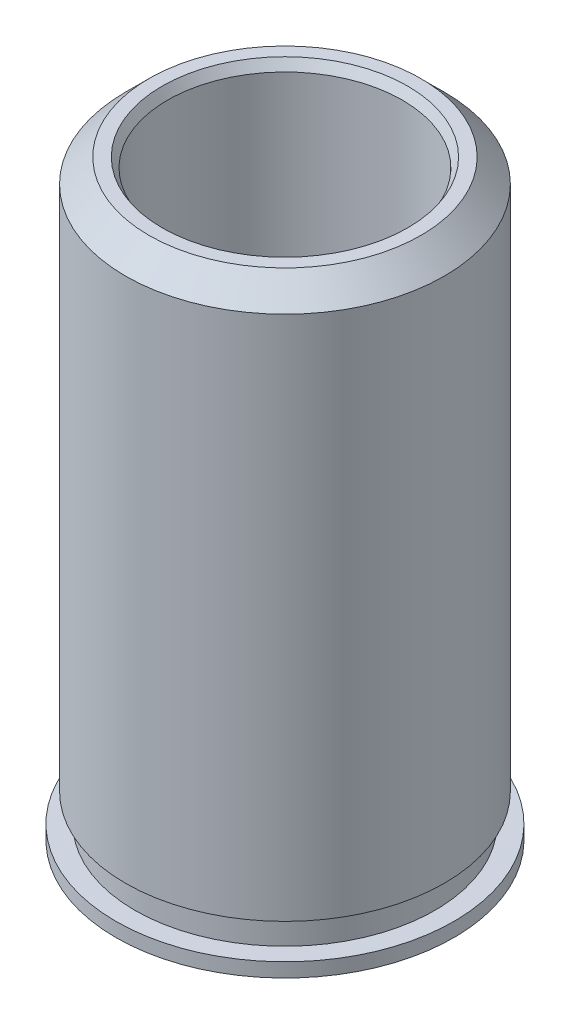
ISO-10303-21;
HEADER;
FILE_DESCRIPTION(('STEP AP214'),'2;1');
FILE_NAME('part.step','',(''),(''),'','','');
FILE_SCHEMA(('AUTOMOTIVE_DESIGN { 1 0 10303 214 1 1 1 1 }'));
ENDSEC;
DATA;
#1=APPLICATION_CONTEXT('core data for automotive mechanical design processes');
#2=APPLICATION_PROTOCOL_DEFINITION('international standard','automotive_design',2000,#1);
#3=PRODUCT_CONTEXT('',#1,'mechanical');
#4=PRODUCT('Part','Part','',(#3));
#5=PRODUCT_RELATED_PRODUCT_CATEGORY('part','',(#4));
#6=PRODUCT_DEFINITION_FORMATION('','',#4);
#7=PRODUCT_DEFINITION_CONTEXT('part definition',#1,'design');
#8=PRODUCT_DEFINITION('design','',#6,#7);
#9=PRODUCT_DEFINITION_SHAPE('','',#8);
#10=(LENGTH_UNIT() NAMED_UNIT(*) SI_UNIT(.MILLI.,.METRE.));
#11=(NAMED_UNIT(*) PLANE_ANGLE_UNIT() SI_UNIT($,.RADIAN.));
#12=(NAMED_UNIT(*) SI_UNIT($,.STERADIAN.) SOLID_ANGLE_UNIT());
#13=UNCERTAINTY_MEASURE_WITH_UNIT(LENGTH_MEASURE(1.E-05),#10,'distance_accuracy_value','');
#14=(GEOMETRIC_REPRESENTATION_CONTEXT(3) GLOBAL_UNCERTAINTY_ASSIGNED_CONTEXT((#13)) GLOBAL_UNIT_ASSIGNED_CONTEXT((#10,
#11,#12)) REPRESENTATION_CONTEXT('',''));
#15=CARTESIAN_POINT('',(0.,0.,0.));
#16=DIRECTION('',(0.,0.,1.));
#17=DIRECTION('',(1.,0.,0.));
#18=AXIS2_PLACEMENT_3D('',#15,#16,#17);
#19=CARTESIAN_POINT('',(0.,8.001,0.));
#20=DIRECTION('',(0.,1.,0.));
#21=DIRECTION('',(0.,0.,1.));
#22=AXIS2_PLACEMENT_3D('',#19,#20,#21);
#23=CYLINDRICAL_SURFACE('',#22,4.572);
#24=CARTESIAN_POINT('',(0.,-8.001,0.));
#25=DIRECTION('',(0.,1.,0.));
#26=DIRECTION('',(0.,0.,1.));
#27=AXIS2_PLACEMENT_3D('',#24,#25,#26);
#28=CIRCLE('',#27,4.572);
#29=CARTESIAN_POINT('',(0.,-8.001,4.572));
#30=VERTEX_POINT('',#29);
#31=EDGE_CURVE('E51',#30,#30,#28,.T.);
#32=ORIENTED_EDGE('',*,*,#31,.T.);
#33=EDGE_LOOP('',(#32));
#34=FACE_BOUND('',#33,.T.);
#35=CARTESIAN_POINT('',(0.,-7.62,0.));
#36=DIRECTION('',(0.,1.,0.));
#37=DIRECTION('',(0.,0.,1.));
#38=AXIS2_PLACEMENT_3D('',#35,#36,#37);
#39=CIRCLE('',#38,4.572);
#40=CARTESIAN_POINT('',(0.,-7.62,4.572));
#41=VERTEX_POINT('',#40);
#42=EDGE_CURVE('E9',#41,#41,#39,.T.);
#43=ORIENTED_EDGE('',*,*,#42,.F.);
#44=EDGE_LOOP('',(#43));
#45=FACE_BOUND('',#44,.T.);
#46=ADVANCED_FACE('F14',(#34,#45),#23,.T.);
#47=CARTESIAN_POINT('',(2.286,-7.62,0.));
#48=DIRECTION('',(0.,1.,0.));
#49=DIRECTION('',(0.,0.,1.));
#50=AXIS2_PLACEMENT_3D('',#47,#48,#49);
#51=PLANE('',#50);
#52=ORIENTED_EDGE('',*,*,#42,.T.);
#53=EDGE_LOOP('',(#52));
#54=FACE_BOUND('',#53,.T.);
#55=CARTESIAN_POINT('',(0.,-7.62,0.));
#56=DIRECTION('',(0.,1.,0.));
#57=DIRECTION('',(0.,0.,1.));
#58=AXIS2_PLACEMENT_3D('',#55,#56,#57);
#59=CIRCLE('',#58,4.05765);
#60=CARTESIAN_POINT('',(0.,-7.62,4.05765));
#61=VERTEX_POINT('',#60);
#62=EDGE_CURVE('E20',#61,#61,#59,.T.);
#63=ORIENTED_EDGE('',*,*,#62,.F.);
#64=EDGE_LOOP('',(#63));
#65=FACE_BOUND('',#64,.T.);
#66=ADVANCED_FACE('F77',(#54,#65),#51,.T.);
#67=CARTESIAN_POINT('',(0.,8.001,0.));
#68=DIRECTION('',(0.,1.,0.));
#69=DIRECTION('',(0.,0.,1.));
#70=AXIS2_PLACEMENT_3D('',#67,#68,#69);
#71=CYLINDRICAL_SURFACE('',#70,4.05765);
#72=ORIENTED_EDGE('',*,*,#62,.T.);
#73=EDGE_LOOP('',(#72));
#74=FACE_BOUND('',#73,.T.);
#75=CARTESIAN_POINT('',(0.,-6.858,0.));
#76=DIRECTION('',(0.,1.,0.));
#77=DIRECTION('',(0.,0.,1.));
#78=AXIS2_PLACEMENT_3D('',#75,#76,#77);
#79=CIRCLE('',#78,4.05765);
#80=CARTESIAN_POINT('',(0.,-6.858,4.05765));
#81=VERTEX_POINT('',#80);
#82=EDGE_CURVE('E24',#81,#81,#79,.T.);
#83=ORIENTED_EDGE('',*,*,#82,.F.);
#84=EDGE_LOOP('',(#83));
#85=FACE_BOUND('',#84,.T.);
#86=ADVANCED_FACE('F82',(#74,#85),#71,.T.);
#87=CARTESIAN_POINT('',(2.286,-6.858,0.));
#88=DIRECTION('',(0.,-1.,0.));
#89=DIRECTION('',(0.,0.,-1.));
#90=AXIS2_PLACEMENT_3D('',#87,#88,#89);
#91=PLANE('',#90);
#92=ORIENTED_EDGE('',*,*,#82,.T.);
#93=EDGE_LOOP('',(#92));
#94=FACE_BOUND('',#93,.T.);
#95=CARTESIAN_POINT('',(0.,-6.858,0.));
#96=DIRECTION('',(0.,1.,0.));
#97=DIRECTION('',(0.,0.,1.));
#98=AXIS2_PLACEMENT_3D('',#95,#96,#97);
#99=CIRCLE('',#98,4.31165);
#100=CARTESIAN_POINT('',(0.,-6.858,4.31165));
#101=VERTEX_POINT('',#100);
#102=EDGE_CURVE('E28',#101,#101,#99,.T.);
#103=ORIENTED_EDGE('',*,*,#102,.F.);
#104=EDGE_LOOP('',(#103));
#105=FACE_BOUND('',#104,.T.);
#106=ADVANCED_FACE('F87',(#94,#105),#91,.T.);
#107=CARTESIAN_POINT('',(0.,8.001,0.));
#108=DIRECTION('',(0.,1.,0.));
#109=DIRECTION('',(0.,0.,1.));
#110=AXIS2_PLACEMENT_3D('',#107,#108,#109);
#111=CYLINDRICAL_SURFACE('',#110,4.31165);
#112=ORIENTED_EDGE('',*,*,#102,.T.);
#113=EDGE_LOOP('',(#112));
#114=FACE_BOUND('',#113,.T.);
#115=CARTESIAN_POINT('',(0.,7.366,0.));
#116=DIRECTION('',(0.,1.,0.));
#117=DIRECTION('',(0.,0.,1.));
#118=AXIS2_PLACEMENT_3D('',#115,#116,#117);
#119=CIRCLE('',#118,4.31164999999999);
#120=CARTESIAN_POINT('',(0.,7.366,4.31164999999999));
#121=VERTEX_POINT('',#120);
#122=EDGE_CURVE('E33',#121,#121,#119,.T.);
#123=ORIENTED_EDGE('',*,*,#122,.F.);
#124=EDGE_LOOP('',(#123));
#125=FACE_BOUND('',#124,.T.);
#126=ADVANCED_FACE('F93',(#114,#125),#111,.T.);
#127=CARTESIAN_POINT('',(0.,8.001,0.));
#128=DIRECTION('',(0.,-1.,0.));
#129=DIRECTION('',(0.,0.,-1.));
#130=AXIS2_PLACEMENT_3D('',#127,#128,#129);
#131=CONICAL_SURFACE('',#130,3.67665,0.785398163397446);
#132=ORIENTED_EDGE('',*,*,#122,.T.);
#133=EDGE_LOOP('',(#132));
#134=FACE_BOUND('',#133,.T.);
#135=CARTESIAN_POINT('',(0.,8.001,0.));
#136=DIRECTION('',(0.,1.,0.));
#137=DIRECTION('',(0.,0.,1.));
#138=AXIS2_PLACEMENT_3D('',#135,#136,#137);
#139=CIRCLE('',#138,3.67665);
#140=CARTESIAN_POINT('',(0.,8.001,3.67665));
#141=VERTEX_POINT('',#140);
#142=EDGE_CURVE('E36',#141,#141,#139,.T.);
#143=ORIENTED_EDGE('',*,*,#142,.F.);
#144=EDGE_LOOP('',(#143));
#145=FACE_BOUND('',#144,.T.);
#146=ADVANCED_FACE('F97',(#134,#145),#131,.T.);
#147=CARTESIAN_POINT('',(2.286,8.001,0.));
#148=DIRECTION('',(0.,1.,0.));
#149=DIRECTION('',(0.,0.,1.));
#150=AXIS2_PLACEMENT_3D('',#147,#148,#149);
#151=PLANE('',#150);
#152=ORIENTED_EDGE('',*,*,#142,.T.);
#153=EDGE_LOOP('',(#152));
#154=FACE_BOUND('',#153,.T.);
#155=CARTESIAN_POINT('',(0.,8.001,0.));
#156=DIRECTION('',(0.,1.,0.));
#157=DIRECTION('',(0.,0.,1.));
#158=AXIS2_PLACEMENT_3D('',#155,#156,#157);
#159=CIRCLE('',#158,3.32164696837417);
#160=CARTESIAN_POINT('',(0.,8.001,3.32164696837417));
#161=VERTEX_POINT('',#160);
#162=EDGE_CURVE('E39',#161,#161,#159,.T.);
#163=ORIENTED_EDGE('',*,*,#162,.F.);
#164=EDGE_LOOP('',(#163));
#165=FACE_BOUND('',#164,.T.);
#166=ADVANCED_FACE('F101',(#154,#165),#151,.T.);
#167=CARTESIAN_POINT('',(0.,7.747,0.));
#168=DIRECTION('',(0.,1.,0.));
#169=DIRECTION('',(0.,0.,1.));
#170=AXIS2_PLACEMENT_3D('',#167,#168,#169);
#171=CONICAL_SURFACE('',#170,3.175,0.523598775598309);
#172=ORIENTED_EDGE('',*,*,#162,.T.);
#173=EDGE_LOOP('',(#172));
#174=FACE_BOUND('',#173,.T.);
#175=CARTESIAN_POINT('',(0.,7.747,0.));
#176=DIRECTION('',(0.,1.,0.));
#177=DIRECTION('',(0.,0.,1.));
#178=AXIS2_PLACEMENT_3D('',#175,#176,#177);
#179=CIRCLE('',#178,3.175);
#180=CARTESIAN_POINT('',(0.,7.747,3.175));
#181=VERTEX_POINT('',#180);
#182=EDGE_CURVE('E42',#181,#181,#179,.T.);
#183=ORIENTED_EDGE('',*,*,#182,.F.);
#184=EDGE_LOOP('',(#183));
#185=FACE_BOUND('',#184,.T.);
#186=ADVANCED_FACE('F73',(#174,#185),#171,.F.);
#187=CARTESIAN_POINT('',(0.,8.001,0.));
#188=DIRECTION('',(0.,1.,0.));
#189=DIRECTION('',(0.,0.,1.));
#190=AXIS2_PLACEMENT_3D('',#187,#188,#189);
#191=CYLINDRICAL_SURFACE('',#190,3.175);
#192=ORIENTED_EDGE('',*,*,#182,.T.);
#193=EDGE_LOOP('',(#192));
#194=FACE_BOUND('',#193,.T.);
#195=CARTESIAN_POINT('',(0.,-7.747,0.));
#196=DIRECTION('',(0.,1.,0.));
#197=DIRECTION('',(0.,0.,1.));
#198=AXIS2_PLACEMENT_3D('',#195,#196,#197);
#199=CIRCLE('',#198,3.175);
#200=CARTESIAN_POINT('',(0.,-7.747,3.175));
#201=VERTEX_POINT('',#200);
#202=EDGE_CURVE('E45',#201,#201,#199,.T.);
#203=ORIENTED_EDGE('',*,*,#202,.F.);
#204=EDGE_LOOP('',(#203));
#205=FACE_BOUND('',#204,.T.);
#206=ADVANCED_FACE('F65',(#194,#205),#191,.F.);
#207=CARTESIAN_POINT('',(0.,-8.001,0.));
#208=DIRECTION('',(0.,-1.,0.));
#209=DIRECTION('',(0.,0.,-1.));
#210=AXIS2_PLACEMENT_3D('',#207,#208,#209);
#211=CONICAL_SURFACE('',#210,3.32164696837416,0.523598775598296);
#212=ORIENTED_EDGE('',*,*,#202,.T.);
#213=EDGE_LOOP('',(#212));
#214=FACE_BOUND('',#213,.T.);
#215=CARTESIAN_POINT('',(0.,-8.001,0.));
#216=DIRECTION('',(0.,1.,0.));
#217=DIRECTION('',(0.,0.,1.));
#218=AXIS2_PLACEMENT_3D('',#215,#216,#217);
#219=CIRCLE('',#218,3.32164696837416);
#220=CARTESIAN_POINT('',(0.,-8.001,3.32164696837416));
#221=VERTEX_POINT('',#220);
#222=EDGE_CURVE('E48',#221,#221,#219,.T.);
#223=ORIENTED_EDGE('',*,*,#222,.F.);
#224=EDGE_LOOP('',(#223));
#225=FACE_BOUND('',#224,.T.);
#226=ADVANCED_FACE('F60',(#214,#225),#211,.F.);
#227=CARTESIAN_POINT('',(2.286,-8.001,0.));
#228=DIRECTION('',(0.,1.,0.));
#229=DIRECTION('',(0.,0.,1.));
#230=AXIS2_PLACEMENT_3D('',#227,#228,#229);
#231=PLANE('',#230);
#232=ORIENTED_EDGE('',*,*,#31,.F.);
#233=EDGE_LOOP('',(#232));
#234=FACE_BOUND('',#233,.T.);
#235=ORIENTED_EDGE('',*,*,#222,.T.);
#236=EDGE_LOOP('',(#235));
#237=FACE_BOUND('',#236,.T.);
#238=ADVANCED_FACE('F57',(#234,#237),#231,.F.);
#239=CLOSED_SHELL('',(#46,#66,#86,#106,#126,#146,#166,#186,#206,#226,#238));
#240=MANIFOLD_SOLID_BREP('B1',#239);
#241=ADVANCED_BREP_SHAPE_REPRESENTATION('',(#18,#240),#14);
#242=SHAPE_DEFINITION_REPRESENTATION(#9,#241);
ENDSEC;
END-ISO-10303-21;
